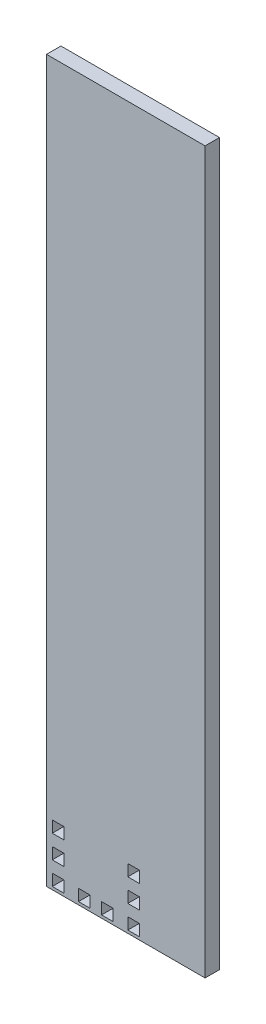
ISO-10303-21;
HEADER;
FILE_DESCRIPTION(('STEP AP214'),'2;1');
FILE_NAME('part.step','',(''),(''),'','','');
FILE_SCHEMA(('AUTOMOTIVE_DESIGN { 1 0 10303 214 1 1 1 1 }'));
ENDSEC;
DATA;
#1=APPLICATION_CONTEXT('core data for automotive mechanical design processes');
#2=APPLICATION_PROTOCOL_DEFINITION('international standard','automotive_design',2000,#1);
#3=PRODUCT_CONTEXT('',#1,'mechanical');
#4=PRODUCT('Part','Part','',(#3));
#5=PRODUCT_RELATED_PRODUCT_CATEGORY('part','',(#4));
#6=PRODUCT_DEFINITION_FORMATION('','',#4);
#7=PRODUCT_DEFINITION_CONTEXT('part definition',#1,'design');
#8=PRODUCT_DEFINITION('design','',#6,#7);
#9=PRODUCT_DEFINITION_SHAPE('','',#8);
#10=(LENGTH_UNIT() NAMED_UNIT(*) SI_UNIT(.MILLI.,.METRE.));
#11=(NAMED_UNIT(*) PLANE_ANGLE_UNIT() SI_UNIT($,.RADIAN.));
#12=(NAMED_UNIT(*) SI_UNIT($,.STERADIAN.) SOLID_ANGLE_UNIT());
#13=UNCERTAINTY_MEASURE_WITH_UNIT(LENGTH_MEASURE(1.E-05),#10,'distance_accuracy_value','');
#14=(GEOMETRIC_REPRESENTATION_CONTEXT(3) GLOBAL_UNCERTAINTY_ASSIGNED_CONTEXT((#13)) GLOBAL_UNIT_ASSIGNED_CONTEXT((#10,
#11,#12)) REPRESENTATION_CONTEXT('',''));
#15=CARTESIAN_POINT('',(0.,0.,0.));
#16=DIRECTION('',(0.,0.,1.));
#17=DIRECTION('',(1.,0.,0.));
#18=AXIS2_PLACEMENT_3D('',#15,#16,#17);
#19=CARTESIAN_POINT('',(0.,0.,5.));
#20=DIRECTION('',(0.,0.,-1.));
#21=DIRECTION('',(-1.,0.,0.));
#22=AXIS2_PLACEMENT_3D('',#19,#20,#21);
#23=PLANE('',#22);
#24=DIRECTION('',(0.,1.,0.));
#25=VECTOR('',#24,1.);
#26=CARTESIAN_POINT('',(15.1,1.,5.));
#27=LINE('',#26,#25);
#28=CARTESIAN_POINT('',(15.1,1.,5.));
#29=VERTEX_POINT('',#28);
#30=CARTESIAN_POINT('',(15.1,5.,5.));
#31=VERTEX_POINT('',#30);
#32=EDGE_CURVE('E302',#29,#31,#27,.T.);
#33=ORIENTED_EDGE('',*,*,#32,.F.);
#34=DIRECTION('',(1.,0.,0.));
#35=VECTOR('',#34,1.);
#36=CARTESIAN_POINT('',(15.1,1.,5.));
#37=LINE('',#36,#35);
#38=CARTESIAN_POINT('',(11.1,1.,5.));
#39=VERTEX_POINT('',#38);
#40=EDGE_CURVE('E310',#39,#29,#37,.T.);
#41=ORIENTED_EDGE('',*,*,#40,.F.);
#42=DIRECTION('',(0.,-1.,0.));
#43=VECTOR('',#42,1.);
#44=CARTESIAN_POINT('',(11.1,1.,5.));
#45=LINE('',#44,#43);
#46=CARTESIAN_POINT('',(11.1,5.,5.));
#47=VERTEX_POINT('',#46);
#48=EDGE_CURVE('E307',#47,#39,#45,.T.);
#49=ORIENTED_EDGE('',*,*,#48,.F.);
#50=DIRECTION('',(-1.,0.,0.));
#51=VECTOR('',#50,1.);
#52=CARTESIAN_POINT('',(15.1,5.,5.));
#53=LINE('',#52,#51);
#54=EDGE_CURVE('E304',#31,#47,#53,.T.);
#55=ORIENTED_EDGE('',*,*,#54,.F.);
#56=EDGE_LOOP('',(#33,#41,#49,#55));
#57=FACE_BOUND('',#56,.T.);
#58=DIRECTION('',(0.,1.,0.));
#59=VECTOR('',#58,1.);
#60=CARTESIAN_POINT('',(32.2,13.,5.));
#61=LINE('',#60,#59);
#62=CARTESIAN_POINT('',(32.2,9.00000000000001,5.));
#63=VERTEX_POINT('',#62);
#64=CARTESIAN_POINT('',(32.2,13.,5.));
#65=VERTEX_POINT('',#64);
#66=EDGE_CURVE('E364',#63,#65,#61,.T.);
#67=ORIENTED_EDGE('',*,*,#66,.F.);
#68=DIRECTION('',(1.,0.,0.));
#69=VECTOR('',#68,1.);
#70=CARTESIAN_POINT('',(32.2,9.00000000000001,5.));
#71=LINE('',#70,#69);
#72=CARTESIAN_POINT('',(28.2,9.00000000000001,5.));
#73=VERTEX_POINT('',#72);
#74=EDGE_CURVE('E372',#73,#63,#71,.T.);
#75=ORIENTED_EDGE('',*,*,#74,.F.);
#76=DIRECTION('',(0.,-1.,0.));
#77=VECTOR('',#76,1.);
#78=CARTESIAN_POINT('',(28.2,13.,5.));
#79=LINE('',#78,#77);
#80=CARTESIAN_POINT('',(28.2,13.,5.));
#81=VERTEX_POINT('',#80);
#82=EDGE_CURVE('E369',#81,#73,#79,.T.);
#83=ORIENTED_EDGE('',*,*,#82,.F.);
#84=DIRECTION('',(-1.,0.,0.));
#85=VECTOR('',#84,1.);
#86=CARTESIAN_POINT('',(32.2,13.,5.));
#87=LINE('',#86,#85);
#88=EDGE_CURVE('E366',#65,#81,#87,.T.);
#89=ORIENTED_EDGE('',*,*,#88,.F.);
#90=EDGE_LOOP('',(#67,#75,#83,#89));
#91=FACE_BOUND('',#90,.T.);
#92=DIRECTION('',(0.,-1.,0.));
#93=VECTOR('',#92,1.);
#94=CARTESIAN_POINT('',(28.2,21.,5.));
#95=LINE('',#94,#93);
#96=CARTESIAN_POINT('',(28.2,21.,5.));
#97=VERTEX_POINT('',#96);
#98=CARTESIAN_POINT('',(28.2,17.,5.));
#99=VERTEX_POINT('',#98);
#100=EDGE_CURVE('E426',#97,#99,#95,.T.);
#101=ORIENTED_EDGE('',*,*,#100,.F.);
#102=DIRECTION('',(-1.,0.,0.));
#103=VECTOR('',#102,1.);
#104=CARTESIAN_POINT('',(32.2,21.,5.));
#105=LINE('',#104,#103);
#106=CARTESIAN_POINT('',(32.2,21.,5.));
#107=VERTEX_POINT('',#106);
#108=EDGE_CURVE('E434',#107,#97,#105,.T.);
#109=ORIENTED_EDGE('',*,*,#108,.F.);
#110=DIRECTION('',(0.,1.,0.));
#111=VECTOR('',#110,1.);
#112=CARTESIAN_POINT('',(32.2,21.,5.));
#113=LINE('',#112,#111);
#114=CARTESIAN_POINT('',(32.2,17.,5.));
#115=VERTEX_POINT('',#114);
#116=EDGE_CURVE('E431',#115,#107,#113,.T.);
#117=ORIENTED_EDGE('',*,*,#116,.F.);
#118=DIRECTION('',(1.,0.,0.));
#119=VECTOR('',#118,1.);
#120=CARTESIAN_POINT('',(32.2,17.,5.));
#121=LINE('',#120,#119);
#122=EDGE_CURVE('E428',#99,#115,#121,.T.);
#123=ORIENTED_EDGE('',*,*,#122,.F.);
#124=EDGE_LOOP('',(#101,#109,#117,#123));
#125=FACE_BOUND('',#124,.T.);
#126=DIRECTION('',(0.,-1.,0.));
#127=VECTOR('',#126,1.);
#128=CARTESIAN_POINT('',(28.2,5.,5.));
#129=LINE('',#128,#127);
#130=CARTESIAN_POINT('',(28.2,5.,5.));
#131=VERTEX_POINT('',#130);
#132=CARTESIAN_POINT('',(28.2,1.,5.));
#133=VERTEX_POINT('',#132);
#134=EDGE_CURVE('E488',#131,#133,#129,.T.);
#135=ORIENTED_EDGE('',*,*,#134,.F.);
#136=DIRECTION('',(-1.,0.,0.));
#137=VECTOR('',#136,1.);
#138=CARTESIAN_POINT('',(32.2,5.,5.));
#139=LINE('',#138,#137);
#140=CARTESIAN_POINT('',(32.2,5.,5.));
#141=VERTEX_POINT('',#140);
#142=EDGE_CURVE('E496',#141,#131,#139,.T.);
#143=ORIENTED_EDGE('',*,*,#142,.F.);
#144=DIRECTION('',(0.,1.,0.));
#145=VECTOR('',#144,1.);
#146=CARTESIAN_POINT('',(32.2,5.,5.));
#147=LINE('',#146,#145);
#148=CARTESIAN_POINT('',(32.2,1.00000000000001,5.));
#149=VERTEX_POINT('',#148);
#150=EDGE_CURVE('E493',#149,#141,#147,.T.);
#151=ORIENTED_EDGE('',*,*,#150,.F.);
#152=DIRECTION('',(1.,0.,0.));
#153=VECTOR('',#152,1.);
#154=CARTESIAN_POINT('',(32.2,1.00000000000001,5.));
#155=LINE('',#154,#153);
#156=EDGE_CURVE('E490',#133,#149,#155,.T.);
#157=ORIENTED_EDGE('',*,*,#156,.F.);
#158=EDGE_LOOP('',(#135,#143,#151,#157));
#159=FACE_BOUND('',#158,.T.);
#160=DIRECTION('',(0.,-1.,0.));
#161=VECTOR('',#160,1.);
#162=CARTESIAN_POINT('',(0.,0.,5.));
#163=LINE('',#162,#161);
#164=CARTESIAN_POINT('',(0.,250.,5.));
#165=VERTEX_POINT('',#164);
#166=CARTESIAN_POINT('',(0.,0.,5.));
#167=VERTEX_POINT('',#166);
#168=EDGE_CURVE('E519',#165,#167,#163,.T.);
#169=ORIENTED_EDGE('',*,*,#168,.T.);
#170=DIRECTION('',(1.,0.,0.));
#171=VECTOR('',#170,1.);
#172=CARTESIAN_POINT('',(0.,0.,5.));
#173=LINE('',#172,#171);
#174=CARTESIAN_POINT('',(55.,0.,5.));
#175=VERTEX_POINT('',#174);
#176=EDGE_CURVE('E522',#167,#175,#173,.T.);
#177=ORIENTED_EDGE('',*,*,#176,.T.);
#178=DIRECTION('',(0.,1.,0.));
#179=VECTOR('',#178,1.);
#180=CARTESIAN_POINT('',(55.,0.,5.));
#181=LINE('',#180,#179);
#182=CARTESIAN_POINT('',(55.,250.,5.));
#183=VERTEX_POINT('',#182);
#184=EDGE_CURVE('E525',#175,#183,#181,.T.);
#185=ORIENTED_EDGE('',*,*,#184,.T.);
#186=DIRECTION('',(-1.,0.,0.));
#187=VECTOR('',#186,1.);
#188=CARTESIAN_POINT('',(0.,250.,5.));
#189=LINE('',#188,#187);
#190=EDGE_CURVE('E527',#183,#165,#189,.T.);
#191=ORIENTED_EDGE('',*,*,#190,.T.);
#192=EDGE_LOOP('',(#169,#177,#185,#191));
#193=FACE_BOUND('',#192,.T.);
#194=DIRECTION('',(-1.,0.,0.));
#195=VECTOR('',#194,1.);
#196=CARTESIAN_POINT('',(6.,5.,5.));
#197=LINE('',#196,#195);
#198=CARTESIAN_POINT('',(6.,5.,5.));
#199=VERTEX_POINT('',#198);
#200=CARTESIAN_POINT('',(2.,5.,5.));
#201=VERTEX_POINT('',#200);
#202=EDGE_CURVE('E457',#199,#201,#197,.T.);
#203=ORIENTED_EDGE('',*,*,#202,.F.);
#204=DIRECTION('',(0.,1.,0.));
#205=VECTOR('',#204,1.);
#206=CARTESIAN_POINT('',(6.,1.,5.));
#207=LINE('',#206,#205);
#208=CARTESIAN_POINT('',(6.,1.,5.));
#209=VERTEX_POINT('',#208);
#210=EDGE_CURVE('E465',#209,#199,#207,.T.);
#211=ORIENTED_EDGE('',*,*,#210,.F.);
#212=DIRECTION('',(1.,0.,0.));
#213=VECTOR('',#212,1.);
#214=CARTESIAN_POINT('',(6.,1.,5.));
#215=LINE('',#214,#213);
#216=CARTESIAN_POINT('',(2.,1.,5.));
#217=VERTEX_POINT('',#216);
#218=EDGE_CURVE('E462',#217,#209,#215,.T.);
#219=ORIENTED_EDGE('',*,*,#218,.F.);
#220=DIRECTION('',(0.,-1.,0.));
#221=VECTOR('',#220,1.);
#222=CARTESIAN_POINT('',(2.,1.,5.));
#223=LINE('',#222,#221);
#224=EDGE_CURVE('E459',#201,#217,#223,.T.);
#225=ORIENTED_EDGE('',*,*,#224,.F.);
#226=EDGE_LOOP('',(#203,#211,#219,#225));
#227=FACE_BOUND('',#226,.T.);
#228=DIRECTION('',(0.,1.,0.));
#229=VECTOR('',#228,1.);
#230=CARTESIAN_POINT('',(5.99999999999999,17.,5.));
#231=LINE('',#230,#229);
#232=CARTESIAN_POINT('',(5.99999999999999,17.,5.));
#233=VERTEX_POINT('',#232);
#234=CARTESIAN_POINT('',(5.99999999999999,21.,5.));
#235=VERTEX_POINT('',#234);
#236=EDGE_CURVE('E395',#233,#235,#231,.T.);
#237=ORIENTED_EDGE('',*,*,#236,.F.);
#238=DIRECTION('',(1.,0.,0.));
#239=VECTOR('',#238,1.);
#240=CARTESIAN_POINT('',(1.99999999999999,17.,5.));
#241=LINE('',#240,#239);
#242=CARTESIAN_POINT('',(1.99999999999999,17.,5.));
#243=VERTEX_POINT('',#242);
#244=EDGE_CURVE('E403',#243,#233,#241,.T.);
#245=ORIENTED_EDGE('',*,*,#244,.F.);
#246=DIRECTION('',(0.,-1.,0.));
#247=VECTOR('',#246,1.);
#248=CARTESIAN_POINT('',(1.99999999999999,17.,5.));
#249=LINE('',#248,#247);
#250=CARTESIAN_POINT('',(1.99999999999999,21.,5.));
#251=VERTEX_POINT('',#250);
#252=EDGE_CURVE('E400',#251,#243,#249,.T.);
#253=ORIENTED_EDGE('',*,*,#252,.F.);
#254=DIRECTION('',(-1.,0.,0.));
#255=VECTOR('',#254,1.);
#256=CARTESIAN_POINT('',(1.99999999999999,21.,5.));
#257=LINE('',#256,#255);
#258=EDGE_CURVE('E397',#235,#251,#257,.T.);
#259=ORIENTED_EDGE('',*,*,#258,.F.);
#260=EDGE_LOOP('',(#237,#245,#253,#259));
#261=FACE_BOUND('',#260,.T.);
#262=DIRECTION('',(0.,1.,0.));
#263=VECTOR('',#262,1.);
#264=CARTESIAN_POINT('',(23.1,1.,5.));
#265=LINE('',#264,#263);
#266=CARTESIAN_POINT('',(23.1,1.,5.));
#267=VERTEX_POINT('',#266);
#268=CARTESIAN_POINT('',(23.1,5.,5.));
#269=VERTEX_POINT('',#268);
#270=EDGE_CURVE('E333',#267,#269,#265,.T.);
#271=ORIENTED_EDGE('',*,*,#270,.F.);
#272=DIRECTION('',(1.,0.,0.));
#273=VECTOR('',#272,1.);
#274=CARTESIAN_POINT('',(23.1,1.,5.));
#275=LINE('',#274,#273);
#276=CARTESIAN_POINT('',(19.1,1.,5.));
#277=VERTEX_POINT('',#276);
#278=EDGE_CURVE('E341',#277,#267,#275,.T.);
#279=ORIENTED_EDGE('',*,*,#278,.F.);
#280=DIRECTION('',(0.,-1.,0.));
#281=VECTOR('',#280,1.);
#282=CARTESIAN_POINT('',(19.1,1.,5.));
#283=LINE('',#282,#281);
#284=CARTESIAN_POINT('',(19.1,5.,5.));
#285=VERTEX_POINT('',#284);
#286=EDGE_CURVE('E338',#285,#277,#283,.T.);
#287=ORIENTED_EDGE('',*,*,#286,.F.);
#288=DIRECTION('',(-1.,0.,0.));
#289=VECTOR('',#288,1.);
#290=CARTESIAN_POINT('',(23.1,5.,5.));
#291=LINE('',#290,#289);
#292=EDGE_CURVE('E335',#269,#285,#291,.T.);
#293=ORIENTED_EDGE('',*,*,#292,.F.);
#294=EDGE_LOOP('',(#271,#279,#287,#293));
#295=FACE_BOUND('',#294,.T.);
#296=DIRECTION('',(0.,-1.,0.));
#297=VECTOR('',#296,1.);
#298=CARTESIAN_POINT('',(2.,9.,5.));
#299=LINE('',#298,#297);
#300=CARTESIAN_POINT('',(2.,13.,5.));
#301=VERTEX_POINT('',#300);
#302=CARTESIAN_POINT('',(2.,9.,5.));
#303=VERTEX_POINT('',#302);
#304=EDGE_CURVE('E266',#301,#303,#299,.T.);
#305=ORIENTED_EDGE('',*,*,#304,.F.);
#306=DIRECTION('',(-1.,0.,0.));
#307=VECTOR('',#306,1.);
#308=CARTESIAN_POINT('',(2.,13.,5.));
#309=LINE('',#308,#307);
#310=CARTESIAN_POINT('',(6.,13.,5.));
#311=VERTEX_POINT('',#310);
#312=EDGE_CURVE('E288',#311,#301,#309,.T.);
#313=ORIENTED_EDGE('',*,*,#312,.F.);
#314=DIRECTION('',(0.,1.,0.));
#315=VECTOR('',#314,1.);
#316=CARTESIAN_POINT('',(6.,9.,5.));
#317=LINE('',#316,#315);
#318=CARTESIAN_POINT('',(6.,9.,5.));
#319=VERTEX_POINT('',#318);
#320=EDGE_CURVE('E286',#319,#311,#317,.T.);
#321=ORIENTED_EDGE('',*,*,#320,.F.);
#322=DIRECTION('',(1.,0.,0.));
#323=VECTOR('',#322,1.);
#324=CARTESIAN_POINT('',(2.,9.,5.));
#325=LINE('',#324,#323);
#326=EDGE_CURVE('E274',#303,#319,#325,.T.);
#327=ORIENTED_EDGE('',*,*,#326,.F.);
#328=EDGE_LOOP('',(#305,#313,#321,#327));
#329=FACE_BOUND('',#328,.T.);
#330=ADVANCED_FACE('F33',(#57,#91,#125,#159,#193,#227,#261,#295,#329),#23,.F.);
#331=CARTESIAN_POINT('',(0.,0.,0.));
#332=DIRECTION('',(0.,0.,-1.));
#333=DIRECTION('',(-1.,0.,0.));
#334=AXIS2_PLACEMENT_3D('',#331,#332,#333);
#335=PLANE('',#334);
#336=DIRECTION('',(1.,0.,0.));
#337=VECTOR('',#336,1.);
#338=CARTESIAN_POINT('',(15.1,1.,0.));
#339=LINE('',#338,#337);
#340=CARTESIAN_POINT('',(11.1,1.,0.));
#341=VERTEX_POINT('',#340);
#342=CARTESIAN_POINT('',(15.1,1.,0.));
#343=VERTEX_POINT('',#342);
#344=EDGE_CURVE('E305',#341,#343,#339,.T.);
#345=ORIENTED_EDGE('',*,*,#344,.T.);
#346=DIRECTION('',(0.,1.,0.));
#347=VECTOR('',#346,1.);
#348=CARTESIAN_POINT('',(15.1,1.,0.));
#349=LINE('',#348,#347);
#350=CARTESIAN_POINT('',(15.1,5.,0.));
#351=VERTEX_POINT('',#350);
#352=EDGE_CURVE('E282',#343,#351,#349,.T.);
#353=ORIENTED_EDGE('',*,*,#352,.T.);
#354=DIRECTION('',(-1.,0.,0.));
#355=VECTOR('',#354,1.);
#356=CARTESIAN_POINT('',(15.1,5.,0.));
#357=LINE('',#356,#355);
#358=CARTESIAN_POINT('',(11.1,5.,0.));
#359=VERTEX_POINT('',#358);
#360=EDGE_CURVE('E315',#351,#359,#357,.T.);
#361=ORIENTED_EDGE('',*,*,#360,.T.);
#362=DIRECTION('',(0.,-1.,0.));
#363=VECTOR('',#362,1.);
#364=CARTESIAN_POINT('',(11.1,1.,0.));
#365=LINE('',#364,#363);
#366=EDGE_CURVE('E318',#359,#341,#365,.T.);
#367=ORIENTED_EDGE('',*,*,#366,.T.);
#368=EDGE_LOOP('',(#345,#353,#361,#367));
#369=FACE_BOUND('',#368,.T.);
#370=DIRECTION('',(1.,0.,0.));
#371=VECTOR('',#370,1.);
#372=CARTESIAN_POINT('',(32.2,9.00000000000001,0.));
#373=LINE('',#372,#371);
#374=CARTESIAN_POINT('',(28.2,9.00000000000001,0.));
#375=VERTEX_POINT('',#374);
#376=CARTESIAN_POINT('',(32.2,9.00000000000001,0.));
#377=VERTEX_POINT('',#376);
#378=EDGE_CURVE('E367',#375,#377,#373,.T.);
#379=ORIENTED_EDGE('',*,*,#378,.T.);
#380=DIRECTION('',(0.,1.,0.));
#381=VECTOR('',#380,1.);
#382=CARTESIAN_POINT('',(32.2,13.,0.));
#383=LINE('',#382,#381);
#384=CARTESIAN_POINT('',(32.2,13.,0.));
#385=VERTEX_POINT('',#384);
#386=EDGE_CURVE('E363',#377,#385,#383,.T.);
#387=ORIENTED_EDGE('',*,*,#386,.T.);
#388=DIRECTION('',(-1.,0.,0.));
#389=VECTOR('',#388,1.);
#390=CARTESIAN_POINT('',(32.2,13.,0.));
#391=LINE('',#390,#389);
#392=CARTESIAN_POINT('',(28.2,13.,0.));
#393=VERTEX_POINT('',#392);
#394=EDGE_CURVE('E377',#385,#393,#391,.T.);
#395=ORIENTED_EDGE('',*,*,#394,.T.);
#396=DIRECTION('',(0.,-1.,0.));
#397=VECTOR('',#396,1.);
#398=CARTESIAN_POINT('',(28.2,13.,0.));
#399=LINE('',#398,#397);
#400=EDGE_CURVE('E380',#393,#375,#399,.T.);
#401=ORIENTED_EDGE('',*,*,#400,.T.);
#402=EDGE_LOOP('',(#379,#387,#395,#401));
#403=FACE_BOUND('',#402,.T.);
#404=DIRECTION('',(-1.,0.,0.));
#405=VECTOR('',#404,1.);
#406=CARTESIAN_POINT('',(32.2,21.,0.));
#407=LINE('',#406,#405);
#408=CARTESIAN_POINT('',(32.2,21.,0.));
#409=VERTEX_POINT('',#408);
#410=CARTESIAN_POINT('',(28.2,21.,0.));
#411=VERTEX_POINT('',#410);
#412=EDGE_CURVE('E429',#409,#411,#407,.T.);
#413=ORIENTED_EDGE('',*,*,#412,.T.);
#414=DIRECTION('',(0.,-1.,0.));
#415=VECTOR('',#414,1.);
#416=CARTESIAN_POINT('',(28.2,21.,0.));
#417=LINE('',#416,#415);
#418=CARTESIAN_POINT('',(28.2,17.,0.));
#419=VERTEX_POINT('',#418);
#420=EDGE_CURVE('E425',#411,#419,#417,.T.);
#421=ORIENTED_EDGE('',*,*,#420,.T.);
#422=DIRECTION('',(1.,0.,0.));
#423=VECTOR('',#422,1.);
#424=CARTESIAN_POINT('',(32.2,17.,0.));
#425=LINE('',#424,#423);
#426=CARTESIAN_POINT('',(32.2,17.,0.));
#427=VERTEX_POINT('',#426);
#428=EDGE_CURVE('E439',#419,#427,#425,.T.);
#429=ORIENTED_EDGE('',*,*,#428,.T.);
#430=DIRECTION('',(0.,1.,0.));
#431=VECTOR('',#430,1.);
#432=CARTESIAN_POINT('',(32.2,21.,0.));
#433=LINE('',#432,#431);
#434=EDGE_CURVE('E442',#427,#409,#433,.T.);
#435=ORIENTED_EDGE('',*,*,#434,.T.);
#436=EDGE_LOOP('',(#413,#421,#429,#435));
#437=FACE_BOUND('',#436,.T.);
#438=DIRECTION('',(-1.,0.,0.));
#439=VECTOR('',#438,1.);
#440=CARTESIAN_POINT('',(32.2,5.,0.));
#441=LINE('',#440,#439);
#442=CARTESIAN_POINT('',(32.2,5.,0.));
#443=VERTEX_POINT('',#442);
#444=CARTESIAN_POINT('',(28.2,5.,0.));
#445=VERTEX_POINT('',#444);
#446=EDGE_CURVE('E491',#443,#445,#441,.T.);
#447=ORIENTED_EDGE('',*,*,#446,.T.);
#448=DIRECTION('',(0.,-1.,0.));
#449=VECTOR('',#448,1.);
#450=CARTESIAN_POINT('',(28.2,5.,0.));
#451=LINE('',#450,#449);
#452=CARTESIAN_POINT('',(28.2,1.,0.));
#453=VERTEX_POINT('',#452);
#454=EDGE_CURVE('E487',#445,#453,#451,.T.);
#455=ORIENTED_EDGE('',*,*,#454,.T.);
#456=DIRECTION('',(1.,0.,0.));
#457=VECTOR('',#456,1.);
#458=CARTESIAN_POINT('',(32.2,1.00000000000001,0.));
#459=LINE('',#458,#457);
#460=CARTESIAN_POINT('',(32.2,1.00000000000001,0.));
#461=VERTEX_POINT('',#460);
#462=EDGE_CURVE('E501',#453,#461,#459,.T.);
#463=ORIENTED_EDGE('',*,*,#462,.T.);
#464=DIRECTION('',(0.,1.,0.));
#465=VECTOR('',#464,1.);
#466=CARTESIAN_POINT('',(32.2,5.,0.));
#467=LINE('',#466,#465);
#468=EDGE_CURVE('E504',#461,#443,#467,.T.);
#469=ORIENTED_EDGE('',*,*,#468,.T.);
#470=EDGE_LOOP('',(#447,#455,#463,#469));
#471=FACE_BOUND('',#470,.T.);
#472=DIRECTION('',(0.,-1.,0.));
#473=VECTOR('',#472,1.);
#474=CARTESIAN_POINT('',(0.,0.,0.));
#475=LINE('',#474,#473);
#476=CARTESIAN_POINT('',(0.,250.,0.));
#477=VERTEX_POINT('',#476);
#478=CARTESIAN_POINT('',(0.,0.,0.));
#479=VERTEX_POINT('',#478);
#480=EDGE_CURVE('E518',#477,#479,#475,.T.);
#481=ORIENTED_EDGE('',*,*,#480,.F.);
#482=DIRECTION('',(-1.,0.,0.));
#483=VECTOR('',#482,1.);
#484=CARTESIAN_POINT('',(0.,250.,0.));
#485=LINE('',#484,#483);
#486=CARTESIAN_POINT('',(55.,250.,0.));
#487=VERTEX_POINT('',#486);
#488=EDGE_CURVE('E523',#487,#477,#485,.T.);
#489=ORIENTED_EDGE('',*,*,#488,.F.);
#490=DIRECTION('',(0.,1.,0.));
#491=VECTOR('',#490,1.);
#492=CARTESIAN_POINT('',(55.,0.,0.));
#493=LINE('',#492,#491);
#494=CARTESIAN_POINT('',(55.,0.,0.));
#495=VERTEX_POINT('',#494);
#496=EDGE_CURVE('E534',#495,#487,#493,.T.);
#497=ORIENTED_EDGE('',*,*,#496,.F.);
#498=DIRECTION('',(1.,0.,0.));
#499=VECTOR('',#498,1.);
#500=CARTESIAN_POINT('',(0.,0.,0.));
#501=LINE('',#500,#499);
#502=EDGE_CURVE('E532',#479,#495,#501,.T.);
#503=ORIENTED_EDGE('',*,*,#502,.F.);
#504=EDGE_LOOP('',(#481,#489,#497,#503));
#505=FACE_BOUND('',#504,.T.);
#506=DIRECTION('',(0.,1.,0.));
#507=VECTOR('',#506,1.);
#508=CARTESIAN_POINT('',(6.,1.,0.));
#509=LINE('',#508,#507);
#510=CARTESIAN_POINT('',(6.,1.,0.));
#511=VERTEX_POINT('',#510);
#512=CARTESIAN_POINT('',(6.,5.,0.));
#513=VERTEX_POINT('',#512);
#514=EDGE_CURVE('E460',#511,#513,#509,.T.);
#515=ORIENTED_EDGE('',*,*,#514,.T.);
#516=DIRECTION('',(-1.,0.,0.));
#517=VECTOR('',#516,1.);
#518=CARTESIAN_POINT('',(6.,5.,0.));
#519=LINE('',#518,#517);
#520=CARTESIAN_POINT('',(2.,5.,0.));
#521=VERTEX_POINT('',#520);
#522=EDGE_CURVE('E456',#513,#521,#519,.T.);
#523=ORIENTED_EDGE('',*,*,#522,.T.);
#524=DIRECTION('',(0.,-1.,0.));
#525=VECTOR('',#524,1.);
#526=CARTESIAN_POINT('',(2.,1.,0.));
#527=LINE('',#526,#525);
#528=CARTESIAN_POINT('',(2.,1.,0.));
#529=VERTEX_POINT('',#528);
#530=EDGE_CURVE('E470',#521,#529,#527,.T.);
#531=ORIENTED_EDGE('',*,*,#530,.T.);
#532=DIRECTION('',(1.,0.,0.));
#533=VECTOR('',#532,1.);
#534=CARTESIAN_POINT('',(6.,1.,0.));
#535=LINE('',#534,#533);
#536=EDGE_CURVE('E473',#529,#511,#535,.T.);
#537=ORIENTED_EDGE('',*,*,#536,.T.);
#538=EDGE_LOOP('',(#515,#523,#531,#537));
#539=FACE_BOUND('',#538,.T.);
#540=DIRECTION('',(1.,0.,0.));
#541=VECTOR('',#540,1.);
#542=CARTESIAN_POINT('',(1.99999999999999,17.,0.));
#543=LINE('',#542,#541);
#544=CARTESIAN_POINT('',(1.99999999999999,17.,0.));
#545=VERTEX_POINT('',#544);
#546=CARTESIAN_POINT('',(5.99999999999999,17.,0.));
#547=VERTEX_POINT('',#546);
#548=EDGE_CURVE('E398',#545,#547,#543,.T.);
#549=ORIENTED_EDGE('',*,*,#548,.T.);
#550=DIRECTION('',(0.,1.,0.));
#551=VECTOR('',#550,1.);
#552=CARTESIAN_POINT('',(5.99999999999999,17.,0.));
#553=LINE('',#552,#551);
#554=CARTESIAN_POINT('',(5.99999999999999,21.,0.));
#555=VERTEX_POINT('',#554);
#556=EDGE_CURVE('E394',#547,#555,#553,.T.);
#557=ORIENTED_EDGE('',*,*,#556,.T.);
#558=DIRECTION('',(-1.,0.,0.));
#559=VECTOR('',#558,1.);
#560=CARTESIAN_POINT('',(1.99999999999999,21.,0.));
#561=LINE('',#560,#559);
#562=CARTESIAN_POINT('',(1.99999999999999,21.,0.));
#563=VERTEX_POINT('',#562);
#564=EDGE_CURVE('E408',#555,#563,#561,.T.);
#565=ORIENTED_EDGE('',*,*,#564,.T.);
#566=DIRECTION('',(0.,-1.,0.));
#567=VECTOR('',#566,1.);
#568=CARTESIAN_POINT('',(1.99999999999999,17.,0.));
#569=LINE('',#568,#567);
#570=EDGE_CURVE('E411',#563,#545,#569,.T.);
#571=ORIENTED_EDGE('',*,*,#570,.T.);
#572=EDGE_LOOP('',(#549,#557,#565,#571));
#573=FACE_BOUND('',#572,.T.);
#574=DIRECTION('',(1.,0.,0.));
#575=VECTOR('',#574,1.);
#576=CARTESIAN_POINT('',(23.1,1.,0.));
#577=LINE('',#576,#575);
#578=CARTESIAN_POINT('',(19.1,1.,0.));
#579=VERTEX_POINT('',#578);
#580=CARTESIAN_POINT('',(23.1,1.,0.));
#581=VERTEX_POINT('',#580);
#582=EDGE_CURVE('E336',#579,#581,#577,.T.);
#583=ORIENTED_EDGE('',*,*,#582,.T.);
#584=DIRECTION('',(0.,1.,0.));
#585=VECTOR('',#584,1.);
#586=CARTESIAN_POINT('',(23.1,1.,0.));
#587=LINE('',#586,#585);
#588=CARTESIAN_POINT('',(23.1,5.,0.));
#589=VERTEX_POINT('',#588);
#590=EDGE_CURVE('E332',#581,#589,#587,.T.);
#591=ORIENTED_EDGE('',*,*,#590,.T.);
#592=DIRECTION('',(-1.,0.,0.));
#593=VECTOR('',#592,1.);
#594=CARTESIAN_POINT('',(23.1,5.,0.));
#595=LINE('',#594,#593);
#596=CARTESIAN_POINT('',(19.1,5.,0.));
#597=VERTEX_POINT('',#596);
#598=EDGE_CURVE('E346',#589,#597,#595,.T.);
#599=ORIENTED_EDGE('',*,*,#598,.T.);
#600=DIRECTION('',(0.,-1.,0.));
#601=VECTOR('',#600,1.);
#602=CARTESIAN_POINT('',(19.1,1.,0.));
#603=LINE('',#602,#601);
#604=EDGE_CURVE('E349',#597,#579,#603,.T.);
#605=ORIENTED_EDGE('',*,*,#604,.T.);
#606=EDGE_LOOP('',(#583,#591,#599,#605));
#607=FACE_BOUND('',#606,.T.);
#608=DIRECTION('',(-1.,0.,0.));
#609=VECTOR('',#608,1.);
#610=CARTESIAN_POINT('',(2.,13.,0.));
#611=LINE('',#610,#609);
#612=CARTESIAN_POINT('',(6.,13.,0.));
#613=VERTEX_POINT('',#612);
#614=CARTESIAN_POINT('',(2.,13.,0.));
#615=VERTEX_POINT('',#614);
#616=EDGE_CURVE('E275',#613,#615,#611,.T.);
#617=ORIENTED_EDGE('',*,*,#616,.T.);
#618=DIRECTION('',(0.,-1.,0.));
#619=VECTOR('',#618,1.);
#620=CARTESIAN_POINT('',(2.,9.,0.));
#621=LINE('',#620,#619);
#622=CARTESIAN_POINT('',(2.,9.,0.));
#623=VERTEX_POINT('',#622);
#624=EDGE_CURVE('E56',#615,#623,#621,.T.);
#625=ORIENTED_EDGE('',*,*,#624,.T.);
#626=DIRECTION('',(1.,0.,0.));
#627=VECTOR('',#626,1.);
#628=CARTESIAN_POINT('',(2.,9.,0.));
#629=LINE('',#628,#627);
#630=CARTESIAN_POINT('',(6.,9.,0.));
#631=VERTEX_POINT('',#630);
#632=EDGE_CURVE('E281',#623,#631,#629,.T.);
#633=ORIENTED_EDGE('',*,*,#632,.T.);
#634=DIRECTION('',(0.,1.,0.));
#635=VECTOR('',#634,1.);
#636=CARTESIAN_POINT('',(6.,9.,0.));
#637=LINE('',#636,#635);
#638=EDGE_CURVE('E294',#631,#613,#637,.T.);
#639=ORIENTED_EDGE('',*,*,#638,.T.);
#640=EDGE_LOOP('',(#617,#625,#633,#639));
#641=FACE_BOUND('',#640,.T.);
#642=ADVANCED_FACE('F552',(#369,#403,#437,#471,#505,#539,#573,#607,#641),#335,.T.);
#643=CARTESIAN_POINT('',(0.,0.,5.));
#644=DIRECTION('',(1.,0.,0.));
#645=DIRECTION('',(0.,0.,-1.));
#646=AXIS2_PLACEMENT_3D('',#643,#644,#645);
#647=PLANE('',#646);
#648=ORIENTED_EDGE('',*,*,#480,.T.);
#649=DIRECTION('',(0.,0.,-1.));
#650=VECTOR('',#649,1.);
#651=CARTESIAN_POINT('',(0.,0.,5.));
#652=LINE('',#651,#650);
#653=EDGE_CURVE('E11',#167,#479,#652,.T.);
#654=ORIENTED_EDGE('',*,*,#653,.F.);
#655=ORIENTED_EDGE('',*,*,#168,.F.);
#656=DIRECTION('',(0.,0.,-1.));
#657=VECTOR('',#656,1.);
#658=CARTESIAN_POINT('',(0.,250.,5.));
#659=LINE('',#658,#657);
#660=EDGE_CURVE('E529',#165,#477,#659,.T.);
#661=ORIENTED_EDGE('',*,*,#660,.T.);
#662=EDGE_LOOP('',(#648,#654,#655,#661));
#663=FACE_BOUND('',#662,.T.);
#664=ADVANCED_FACE('F35',(#663),#647,.F.);
#665=CARTESIAN_POINT('',(0.,0.,5.));
#666=DIRECTION('',(0.,1.,0.));
#667=DIRECTION('',(0.,0.,1.));
#668=AXIS2_PLACEMENT_3D('',#665,#666,#667);
#669=PLANE('',#668);
#670=ORIENTED_EDGE('',*,*,#502,.T.);
#671=DIRECTION('',(0.,0.,-1.));
#672=VECTOR('',#671,1.);
#673=CARTESIAN_POINT('',(55.,0.,5.));
#674=LINE('',#673,#672);
#675=EDGE_CURVE('E41',#175,#495,#674,.T.);
#676=ORIENTED_EDGE('',*,*,#675,.F.);
#677=ORIENTED_EDGE('',*,*,#176,.F.);
#678=ORIENTED_EDGE('',*,*,#653,.T.);
#679=EDGE_LOOP('',(#670,#676,#677,#678));
#680=FACE_BOUND('',#679,.T.);
#681=ADVANCED_FACE('F563',(#680),#669,.F.);
#682=CARTESIAN_POINT('',(55.,0.,5.));
#683=DIRECTION('',(-1.,0.,0.));
#684=DIRECTION('',(0.,0.,1.));
#685=AXIS2_PLACEMENT_3D('',#682,#683,#684);
#686=PLANE('',#685);
#687=ORIENTED_EDGE('',*,*,#496,.T.);
#688=DIRECTION('',(0.,0.,-1.));
#689=VECTOR('',#688,1.);
#690=CARTESIAN_POINT('',(55.,250.,5.));
#691=LINE('',#690,#689);
#692=EDGE_CURVE('E539',#183,#487,#691,.T.);
#693=ORIENTED_EDGE('',*,*,#692,.F.);
#694=ORIENTED_EDGE('',*,*,#184,.F.);
#695=ORIENTED_EDGE('',*,*,#675,.T.);
#696=EDGE_LOOP('',(#687,#693,#694,#695));
#697=FACE_BOUND('',#696,.T.);
#698=ADVANCED_FACE('F546',(#697),#686,.F.);
#699=CARTESIAN_POINT('',(0.,250.,5.));
#700=DIRECTION('',(0.,-1.,0.));
#701=DIRECTION('',(0.,0.,-1.));
#702=AXIS2_PLACEMENT_3D('',#699,#700,#701);
#703=PLANE('',#702);
#704=ORIENTED_EDGE('',*,*,#488,.T.);
#705=ORIENTED_EDGE('',*,*,#660,.F.);
#706=ORIENTED_EDGE('',*,*,#190,.F.);
#707=ORIENTED_EDGE('',*,*,#692,.T.);
#708=EDGE_LOOP('',(#704,#705,#706,#707));
#709=FACE_BOUND('',#708,.T.);
#710=ADVANCED_FACE('F556',(#709),#703,.F.);
#711=CARTESIAN_POINT('',(28.2,5.,5.));
#712=DIRECTION('',(1.,0.,0.));
#713=DIRECTION('',(0.,0.,-1.));
#714=AXIS2_PLACEMENT_3D('',#711,#712,#713);
#715=PLANE('',#714);
#716=ORIENTED_EDGE('',*,*,#454,.F.);
#717=DIRECTION('',(0.,0.,-1.));
#718=VECTOR('',#717,1.);
#719=CARTESIAN_POINT('',(28.2,5.,5.));
#720=LINE('',#719,#718);
#721=EDGE_CURVE('E498',#131,#445,#720,.T.);
#722=ORIENTED_EDGE('',*,*,#721,.F.);
#723=ORIENTED_EDGE('',*,*,#134,.T.);
#724=DIRECTION('',(0.,0.,-1.));
#725=VECTOR('',#724,1.);
#726=CARTESIAN_POINT('',(28.2,1.,5.));
#727=LINE('',#726,#725);
#728=EDGE_CURVE('E515',#133,#453,#727,.T.);
#729=ORIENTED_EDGE('',*,*,#728,.T.);
#730=EDGE_LOOP('',(#716,#722,#723,#729));
#731=FACE_BOUND('',#730,.T.);
#732=ADVANCED_FACE('F581',(#731),#715,.T.);
#733=CARTESIAN_POINT('',(32.2,1.00000000000001,5.));
#734=DIRECTION('',(0.,1.,0.));
#735=DIRECTION('',(-1.,0.,0.));
#736=AXIS2_PLACEMENT_3D('',#733,#734,#735);
#737=PLANE('',#736);
#738=ORIENTED_EDGE('',*,*,#462,.F.);
#739=ORIENTED_EDGE('',*,*,#728,.F.);
#740=ORIENTED_EDGE('',*,*,#156,.T.);
#741=DIRECTION('',(0.,0.,-1.));
#742=VECTOR('',#741,1.);
#743=CARTESIAN_POINT('',(32.2,1.00000000000001,5.));
#744=LINE('',#743,#742);
#745=EDGE_CURVE('E513',#149,#461,#744,.T.);
#746=ORIENTED_EDGE('',*,*,#745,.T.);
#747=EDGE_LOOP('',(#738,#739,#740,#746));
#748=FACE_BOUND('',#747,.T.);
#749=ADVANCED_FACE('F588',(#748),#737,.T.);
#750=CARTESIAN_POINT('',(32.2,5.,5.));
#751=DIRECTION('',(-1.,0.,0.));
#752=DIRECTION('',(0.,0.,1.));
#753=AXIS2_PLACEMENT_3D('',#750,#751,#752);
#754=PLANE('',#753);
#755=ORIENTED_EDGE('',*,*,#468,.F.);
#756=ORIENTED_EDGE('',*,*,#745,.F.);
#757=ORIENTED_EDGE('',*,*,#150,.T.);
#758=DIRECTION('',(0.,0.,-1.));
#759=VECTOR('',#758,1.);
#760=CARTESIAN_POINT('',(32.2,5.,5.));
#761=LINE('',#760,#759);
#762=EDGE_CURVE('E511',#141,#443,#761,.T.);
#763=ORIENTED_EDGE('',*,*,#762,.T.);
#764=EDGE_LOOP('',(#755,#756,#757,#763));
#765=FACE_BOUND('',#764,.T.);
#766=ADVANCED_FACE('F593',(#765),#754,.T.);
#767=CARTESIAN_POINT('',(32.2,5.,5.));
#768=DIRECTION('',(0.,-1.,0.));
#769=DIRECTION('',(0.,0.,-1.));
#770=AXIS2_PLACEMENT_3D('',#767,#768,#769);
#771=PLANE('',#770);
#772=ORIENTED_EDGE('',*,*,#446,.F.);
#773=ORIENTED_EDGE('',*,*,#762,.F.);
#774=ORIENTED_EDGE('',*,*,#142,.T.);
#775=ORIENTED_EDGE('',*,*,#721,.T.);
#776=EDGE_LOOP('',(#772,#773,#774,#775));
#777=FACE_BOUND('',#776,.T.);
#778=ADVANCED_FACE('F601',(#777),#771,.T.);
#779=CARTESIAN_POINT('',(6.,5.,5.));
#780=DIRECTION('',(0.,-1.,0.));
#781=DIRECTION('',(1.,0.,0.));
#782=AXIS2_PLACEMENT_3D('',#779,#780,#781);
#783=PLANE('',#782);
#784=ORIENTED_EDGE('',*,*,#522,.F.);
#785=DIRECTION('',(0.,0.,-1.));
#786=VECTOR('',#785,1.);
#787=CARTESIAN_POINT('',(6.,5.,5.));
#788=LINE('',#787,#786);
#789=EDGE_CURVE('E467',#199,#513,#788,.T.);
#790=ORIENTED_EDGE('',*,*,#789,.F.);
#791=ORIENTED_EDGE('',*,*,#202,.T.);
#792=DIRECTION('',(0.,0.,-1.));
#793=VECTOR('',#792,1.);
#794=CARTESIAN_POINT('',(2.,5.,5.));
#795=LINE('',#794,#793);
#796=EDGE_CURVE('E484',#201,#521,#795,.T.);
#797=ORIENTED_EDGE('',*,*,#796,.T.);
#798=EDGE_LOOP('',(#784,#790,#791,#797));
#799=FACE_BOUND('',#798,.T.);
#800=ADVANCED_FACE('F614',(#799),#783,.T.);
#801=CARTESIAN_POINT('',(2.,1.,5.));
#802=DIRECTION('',(1.,0.,0.));
#803=DIRECTION('',(0.,0.,-1.));
#804=AXIS2_PLACEMENT_3D('',#801,#802,#803);
#805=PLANE('',#804);
#806=ORIENTED_EDGE('',*,*,#530,.F.);
#807=ORIENTED_EDGE('',*,*,#796,.F.);
#808=ORIENTED_EDGE('',*,*,#224,.T.);
#809=DIRECTION('',(0.,0.,-1.));
#810=VECTOR('',#809,1.);
#811=CARTESIAN_POINT('',(2.,1.,5.));
#812=LINE('',#811,#810);
#813=EDGE_CURVE('E482',#217,#529,#812,.T.);
#814=ORIENTED_EDGE('',*,*,#813,.T.);
#815=EDGE_LOOP('',(#806,#807,#808,#814));
#816=FACE_BOUND('',#815,.T.);
#817=ADVANCED_FACE('F619',(#816),#805,.T.);
#818=CARTESIAN_POINT('',(6.,1.,5.));
#819=DIRECTION('',(0.,1.,0.));
#820=DIRECTION('',(-1.,0.,0.));
#821=AXIS2_PLACEMENT_3D('',#818,#819,#820);
#822=PLANE('',#821);
#823=ORIENTED_EDGE('',*,*,#536,.F.);
#824=ORIENTED_EDGE('',*,*,#813,.F.);
#825=ORIENTED_EDGE('',*,*,#218,.T.);
#826=DIRECTION('',(0.,0.,-1.));
#827=VECTOR('',#826,1.);
#828=CARTESIAN_POINT('',(6.,1.,5.));
#829=LINE('',#828,#827);
#830=EDGE_CURVE('E480',#209,#511,#829,.T.);
#831=ORIENTED_EDGE('',*,*,#830,.T.);
#832=EDGE_LOOP('',(#823,#824,#825,#831));
#833=FACE_BOUND('',#832,.T.);
#834=ADVANCED_FACE('F623',(#833),#822,.T.);
#835=CARTESIAN_POINT('',(6.,1.,5.));
#836=DIRECTION('',(-1.,0.,0.));
#837=DIRECTION('',(0.,-1.,0.));
#838=AXIS2_PLACEMENT_3D('',#835,#836,#837);
#839=PLANE('',#838);
#840=ORIENTED_EDGE('',*,*,#514,.F.);
#841=ORIENTED_EDGE('',*,*,#830,.F.);
#842=ORIENTED_EDGE('',*,*,#210,.T.);
#843=ORIENTED_EDGE('',*,*,#789,.T.);
#844=EDGE_LOOP('',(#840,#841,#842,#843));
#845=FACE_BOUND('',#844,.T.);
#846=ADVANCED_FACE('F627',(#845),#839,.T.);
#847=CARTESIAN_POINT('',(28.2,21.,5.));
#848=DIRECTION('',(1.,0.,0.));
#849=DIRECTION('',(0.,0.,-1.));
#850=AXIS2_PLACEMENT_3D('',#847,#848,#849);
#851=PLANE('',#850);
#852=ORIENTED_EDGE('',*,*,#420,.F.);
#853=DIRECTION('',(0.,0.,-1.));
#854=VECTOR('',#853,1.);
#855=CARTESIAN_POINT('',(28.2,21.,5.));
#856=LINE('',#855,#854);
#857=EDGE_CURVE('E436',#97,#411,#856,.T.);
#858=ORIENTED_EDGE('',*,*,#857,.F.);
#859=ORIENTED_EDGE('',*,*,#100,.T.);
#860=DIRECTION('',(0.,0.,-1.));
#861=VECTOR('',#860,1.);
#862=CARTESIAN_POINT('',(28.2,17.,5.));
#863=LINE('',#862,#861);
#864=EDGE_CURVE('E453',#99,#419,#863,.T.);
#865=ORIENTED_EDGE('',*,*,#864,.T.);
#866=EDGE_LOOP('',(#852,#858,#859,#865));
#867=FACE_BOUND('',#866,.T.);
#868=ADVANCED_FACE('F631',(#867),#851,.T.);
#869=CARTESIAN_POINT('',(32.2,17.,5.));
#870=DIRECTION('',(0.,1.,0.));
#871=DIRECTION('',(0.,0.,1.));
#872=AXIS2_PLACEMENT_3D('',#869,#870,#871);
#873=PLANE('',#872);
#874=ORIENTED_EDGE('',*,*,#428,.F.);
#875=ORIENTED_EDGE('',*,*,#864,.F.);
#876=ORIENTED_EDGE('',*,*,#122,.T.);
#877=DIRECTION('',(0.,0.,-1.));
#878=VECTOR('',#877,1.);
#879=CARTESIAN_POINT('',(32.2,17.,5.));
#880=LINE('',#879,#878);
#881=EDGE_CURVE('E451',#115,#427,#880,.T.);
#882=ORIENTED_EDGE('',*,*,#881,.T.);
#883=EDGE_LOOP('',(#874,#875,#876,#882));
#884=FACE_BOUND('',#883,.T.);
#885=ADVANCED_FACE('F635',(#884),#873,.T.);
#886=CARTESIAN_POINT('',(32.2,21.,5.));
#887=DIRECTION('',(-1.,0.,0.));
#888=DIRECTION('',(0.,-1.,0.));
#889=AXIS2_PLACEMENT_3D('',#886,#887,#888);
#890=PLANE('',#889);
#891=ORIENTED_EDGE('',*,*,#434,.F.);
#892=ORIENTED_EDGE('',*,*,#881,.F.);
#893=ORIENTED_EDGE('',*,*,#116,.T.);
#894=DIRECTION('',(0.,0.,-1.));
#895=VECTOR('',#894,1.);
#896=CARTESIAN_POINT('',(32.2,21.,5.));
#897=LINE('',#896,#895);
#898=EDGE_CURVE('E449',#107,#409,#897,.T.);
#899=ORIENTED_EDGE('',*,*,#898,.T.);
#900=EDGE_LOOP('',(#891,#892,#893,#899));
#901=FACE_BOUND('',#900,.T.);
#902=ADVANCED_FACE('F639',(#901),#890,.T.);
#903=CARTESIAN_POINT('',(32.2,21.,5.));
#904=DIRECTION('',(0.,-1.,0.));
#905=DIRECTION('',(0.,0.,-1.));
#906=AXIS2_PLACEMENT_3D('',#903,#904,#905);
#907=PLANE('',#906);
#908=ORIENTED_EDGE('',*,*,#412,.F.);
#909=ORIENTED_EDGE('',*,*,#898,.F.);
#910=ORIENTED_EDGE('',*,*,#108,.T.);
#911=ORIENTED_EDGE('',*,*,#857,.T.);
#912=EDGE_LOOP('',(#908,#909,#910,#911));
#913=FACE_BOUND('',#912,.T.);
#914=ADVANCED_FACE('F643',(#913),#907,.T.);
#915=CARTESIAN_POINT('',(5.99999999999999,17.,5.));
#916=DIRECTION('',(-1.,0.,0.));
#917=DIRECTION('',(0.,-1.,0.));
#918=AXIS2_PLACEMENT_3D('',#915,#916,#917);
#919=PLANE('',#918);
#920=ORIENTED_EDGE('',*,*,#556,.F.);
#921=DIRECTION('',(0.,0.,-1.));
#922=VECTOR('',#921,1.);
#923=CARTESIAN_POINT('',(5.99999999999999,17.,5.));
#924=LINE('',#923,#922);
#925=EDGE_CURVE('E405',#233,#547,#924,.T.);
#926=ORIENTED_EDGE('',*,*,#925,.F.);
#927=ORIENTED_EDGE('',*,*,#236,.T.);
#928=DIRECTION('',(0.,0.,-1.));
#929=VECTOR('',#928,1.);
#930=CARTESIAN_POINT('',(5.99999999999999,21.,5.));
#931=LINE('',#930,#929);
#932=EDGE_CURVE('E422',#235,#555,#931,.T.);
#933=ORIENTED_EDGE('',*,*,#932,.T.);
#934=EDGE_LOOP('',(#920,#926,#927,#933));
#935=FACE_BOUND('',#934,.T.);
#936=ADVANCED_FACE('F647',(#935),#919,.T.);
#937=CARTESIAN_POINT('',(1.99999999999999,21.,5.));
#938=DIRECTION('',(0.,-1.,0.));
#939=DIRECTION('',(1.,0.,0.));
#940=AXIS2_PLACEMENT_3D('',#937,#938,#939);
#941=PLANE('',#940);
#942=ORIENTED_EDGE('',*,*,#564,.F.);
#943=ORIENTED_EDGE('',*,*,#932,.F.);
#944=ORIENTED_EDGE('',*,*,#258,.T.);
#945=DIRECTION('',(0.,0.,-1.));
#946=VECTOR('',#945,1.);
#947=CARTESIAN_POINT('',(1.99999999999999,21.,5.));
#948=LINE('',#947,#946);
#949=EDGE_CURVE('E420',#251,#563,#948,.T.);
#950=ORIENTED_EDGE('',*,*,#949,.T.);
#951=EDGE_LOOP('',(#942,#943,#944,#950));
#952=FACE_BOUND('',#951,.T.);
#953=ADVANCED_FACE('F651',(#952),#941,.T.);
#954=CARTESIAN_POINT('',(1.99999999999999,17.,5.));
#955=DIRECTION('',(1.,0.,0.));
#956=DIRECTION('',(0.,1.,0.));
#957=AXIS2_PLACEMENT_3D('',#954,#955,#956);
#958=PLANE('',#957);
#959=ORIENTED_EDGE('',*,*,#570,.F.);
#960=ORIENTED_EDGE('',*,*,#949,.F.);
#961=ORIENTED_EDGE('',*,*,#252,.T.);
#962=DIRECTION('',(0.,0.,-1.));
#963=VECTOR('',#962,1.);
#964=CARTESIAN_POINT('',(1.99999999999999,17.,5.));
#965=LINE('',#964,#963);
#966=EDGE_CURVE('E418',#243,#545,#965,.T.);
#967=ORIENTED_EDGE('',*,*,#966,.T.);
#968=EDGE_LOOP('',(#959,#960,#961,#967));
#969=FACE_BOUND('',#968,.T.);
#970=ADVANCED_FACE('F655',(#969),#958,.T.);
#971=CARTESIAN_POINT('',(1.99999999999999,17.,5.));
#972=DIRECTION('',(0.,1.,0.));
#973=DIRECTION('',(0.,0.,1.));
#974=AXIS2_PLACEMENT_3D('',#971,#972,#973);
#975=PLANE('',#974);
#976=ORIENTED_EDGE('',*,*,#548,.F.);
#977=ORIENTED_EDGE('',*,*,#966,.F.);
#978=ORIENTED_EDGE('',*,*,#244,.T.);
#979=ORIENTED_EDGE('',*,*,#925,.T.);
#980=EDGE_LOOP('',(#976,#977,#978,#979));
#981=FACE_BOUND('',#980,.T.);
#982=ADVANCED_FACE('F659',(#981),#975,.T.);
#983=CARTESIAN_POINT('',(32.2,13.,5.));
#984=DIRECTION('',(-1.,0.,0.));
#985=DIRECTION('',(0.,0.,1.));
#986=AXIS2_PLACEMENT_3D('',#983,#984,#985);
#987=PLANE('',#986);
#988=ORIENTED_EDGE('',*,*,#386,.F.);
#989=DIRECTION('',(0.,0.,-1.));
#990=VECTOR('',#989,1.);
#991=CARTESIAN_POINT('',(32.2,9.00000000000001,5.));
#992=LINE('',#991,#990);
#993=EDGE_CURVE('E374',#63,#377,#992,.T.);
#994=ORIENTED_EDGE('',*,*,#993,.F.);
#995=ORIENTED_EDGE('',*,*,#66,.T.);
#996=DIRECTION('',(0.,0.,-1.));
#997=VECTOR('',#996,1.);
#998=CARTESIAN_POINT('',(32.2,13.,5.));
#999=LINE('',#998,#997);
#1000=EDGE_CURVE('E391',#65,#385,#999,.T.);
#1001=ORIENTED_EDGE('',*,*,#1000,.T.);
#1002=EDGE_LOOP('',(#988,#994,#995,#1001));
#1003=FACE_BOUND('',#1002,.T.);
#1004=ADVANCED_FACE('F663',(#1003),#987,.T.);
#1005=CARTESIAN_POINT('',(32.2,13.,5.));
#1006=DIRECTION('',(0.,-1.,0.));
#1007=DIRECTION('',(0.,0.,-1.));
#1008=AXIS2_PLACEMENT_3D('',#1005,#1006,#1007);
#1009=PLANE('',#1008);
#1010=ORIENTED_EDGE('',*,*,#394,.F.);
#1011=ORIENTED_EDGE('',*,*,#1000,.F.);
#1012=ORIENTED_EDGE('',*,*,#88,.T.);
#1013=DIRECTION('',(0.,0.,-1.));
#1014=VECTOR('',#1013,1.);
#1015=CARTESIAN_POINT('',(28.2,13.,5.));
#1016=LINE('',#1015,#1014);
#1017=EDGE_CURVE('E389',#81,#393,#1016,.T.);
#1018=ORIENTED_EDGE('',*,*,#1017,.T.);
#1019=EDGE_LOOP('',(#1010,#1011,#1012,#1018));
#1020=FACE_BOUND('',#1019,.T.);
#1021=ADVANCED_FACE('F667',(#1020),#1009,.T.);
#1022=CARTESIAN_POINT('',(28.2,13.,5.));
#1023=DIRECTION('',(1.,0.,0.));
#1024=DIRECTION('',(0.,1.,0.));
#1025=AXIS2_PLACEMENT_3D('',#1022,#1023,#1024);
#1026=PLANE('',#1025);
#1027=ORIENTED_EDGE('',*,*,#400,.F.);
#1028=ORIENTED_EDGE('',*,*,#1017,.F.);
#1029=ORIENTED_EDGE('',*,*,#82,.T.);
#1030=DIRECTION('',(0.,0.,-1.));
#1031=VECTOR('',#1030,1.);
#1032=CARTESIAN_POINT('',(28.2,9.00000000000001,5.));
#1033=LINE('',#1032,#1031);
#1034=EDGE_CURVE('E387',#73,#375,#1033,.T.);
#1035=ORIENTED_EDGE('',*,*,#1034,.T.);
#1036=EDGE_LOOP('',(#1027,#1028,#1029,#1035));
#1037=FACE_BOUND('',#1036,.T.);
#1038=ADVANCED_FACE('F671',(#1037),#1026,.T.);
#1039=CARTESIAN_POINT('',(32.2,9.00000000000001,5.));
#1040=DIRECTION('',(0.,1.,0.));
#1041=DIRECTION('',(-1.,0.,0.));
#1042=AXIS2_PLACEMENT_3D('',#1039,#1040,#1041);
#1043=PLANE('',#1042);
#1044=ORIENTED_EDGE('',*,*,#378,.F.);
#1045=ORIENTED_EDGE('',*,*,#1034,.F.);
#1046=ORIENTED_EDGE('',*,*,#74,.T.);
#1047=ORIENTED_EDGE('',*,*,#993,.T.);
#1048=EDGE_LOOP('',(#1044,#1045,#1046,#1047));
#1049=FACE_BOUND('',#1048,.T.);
#1050=ADVANCED_FACE('F675',(#1049),#1043,.T.);
#1051=CARTESIAN_POINT('',(23.1,1.,5.));
#1052=DIRECTION('',(-1.,0.,0.));
#1053=DIRECTION('',(0.,-1.,0.));
#1054=AXIS2_PLACEMENT_3D('',#1051,#1052,#1053);
#1055=PLANE('',#1054);
#1056=ORIENTED_EDGE('',*,*,#590,.F.);
#1057=DIRECTION('',(0.,0.,-1.));
#1058=VECTOR('',#1057,1.);
#1059=CARTESIAN_POINT('',(23.1,1.,5.));
#1060=LINE('',#1059,#1058);
#1061=EDGE_CURVE('E343',#267,#581,#1060,.T.);
#1062=ORIENTED_EDGE('',*,*,#1061,.F.);
#1063=ORIENTED_EDGE('',*,*,#270,.T.);
#1064=DIRECTION('',(0.,0.,-1.));
#1065=VECTOR('',#1064,1.);
#1066=CARTESIAN_POINT('',(23.1,5.,5.));
#1067=LINE('',#1066,#1065);
#1068=EDGE_CURVE('E360',#269,#589,#1067,.T.);
#1069=ORIENTED_EDGE('',*,*,#1068,.T.);
#1070=EDGE_LOOP('',(#1056,#1062,#1063,#1069));
#1071=FACE_BOUND('',#1070,.T.);
#1072=ADVANCED_FACE('F679',(#1071),#1055,.T.);
#1073=CARTESIAN_POINT('',(23.1,5.,5.));
#1074=DIRECTION('',(0.,-1.,0.));
#1075=DIRECTION('',(1.,0.,0.));
#1076=AXIS2_PLACEMENT_3D('',#1073,#1074,#1075);
#1077=PLANE('',#1076);
#1078=ORIENTED_EDGE('',*,*,#598,.F.);
#1079=ORIENTED_EDGE('',*,*,#1068,.F.);
#1080=ORIENTED_EDGE('',*,*,#292,.T.);
#1081=DIRECTION('',(0.,0.,-1.));
#1082=VECTOR('',#1081,1.);
#1083=CARTESIAN_POINT('',(19.1,5.,5.));
#1084=LINE('',#1083,#1082);
#1085=EDGE_CURVE('E358',#285,#597,#1084,.T.);
#1086=ORIENTED_EDGE('',*,*,#1085,.T.);
#1087=EDGE_LOOP('',(#1078,#1079,#1080,#1086));
#1088=FACE_BOUND('',#1087,.T.);
#1089=ADVANCED_FACE('F683',(#1088),#1077,.T.);
#1090=CARTESIAN_POINT('',(19.1,1.,5.));
#1091=DIRECTION('',(1.,0.,0.));
#1092=DIRECTION('',(0.,0.,-1.));
#1093=AXIS2_PLACEMENT_3D('',#1090,#1091,#1092);
#1094=PLANE('',#1093);
#1095=ORIENTED_EDGE('',*,*,#604,.F.);
#1096=ORIENTED_EDGE('',*,*,#1085,.F.);
#1097=ORIENTED_EDGE('',*,*,#286,.T.);
#1098=DIRECTION('',(0.,0.,-1.));
#1099=VECTOR('',#1098,1.);
#1100=CARTESIAN_POINT('',(19.1,1.,5.));
#1101=LINE('',#1100,#1099);
#1102=EDGE_CURVE('E356',#277,#579,#1101,.T.);
#1103=ORIENTED_EDGE('',*,*,#1102,.T.);
#1104=EDGE_LOOP('',(#1095,#1096,#1097,#1103));
#1105=FACE_BOUND('',#1104,.T.);
#1106=ADVANCED_FACE('F687',(#1105),#1094,.T.);
#1107=CARTESIAN_POINT('',(23.1,1.,5.));
#1108=DIRECTION('',(0.,1.,0.));
#1109=DIRECTION('',(-1.,0.,0.));
#1110=AXIS2_PLACEMENT_3D('',#1107,#1108,#1109);
#1111=PLANE('',#1110);
#1112=ORIENTED_EDGE('',*,*,#582,.F.);
#1113=ORIENTED_EDGE('',*,*,#1102,.F.);
#1114=ORIENTED_EDGE('',*,*,#278,.T.);
#1115=ORIENTED_EDGE('',*,*,#1061,.T.);
#1116=EDGE_LOOP('',(#1112,#1113,#1114,#1115));
#1117=FACE_BOUND('',#1116,.T.);
#1118=ADVANCED_FACE('F691',(#1117),#1111,.T.);
#1119=CARTESIAN_POINT('',(15.1,1.,5.));
#1120=DIRECTION('',(-1.,0.,0.));
#1121=DIRECTION('',(0.,0.,1.));
#1122=AXIS2_PLACEMENT_3D('',#1119,#1120,#1121);
#1123=PLANE('',#1122);
#1124=ORIENTED_EDGE('',*,*,#352,.F.);
#1125=DIRECTION('',(0.,0.,-1.));
#1126=VECTOR('',#1125,1.);
#1127=CARTESIAN_POINT('',(15.1,1.,5.));
#1128=LINE('',#1127,#1126);
#1129=EDGE_CURVE('E312',#29,#343,#1128,.T.);
#1130=ORIENTED_EDGE('',*,*,#1129,.F.);
#1131=ORIENTED_EDGE('',*,*,#32,.T.);
#1132=DIRECTION('',(0.,0.,-1.));
#1133=VECTOR('',#1132,1.);
#1134=CARTESIAN_POINT('',(15.1,5.,5.));
#1135=LINE('',#1134,#1133);
#1136=EDGE_CURVE('E329',#31,#351,#1135,.T.);
#1137=ORIENTED_EDGE('',*,*,#1136,.T.);
#1138=EDGE_LOOP('',(#1124,#1130,#1131,#1137));
#1139=FACE_BOUND('',#1138,.T.);
#1140=ADVANCED_FACE('F695',(#1139),#1123,.T.);
#1141=CARTESIAN_POINT('',(15.1,5.,5.));
#1142=DIRECTION('',(0.,-1.,0.));
#1143=DIRECTION('',(1.,0.,0.));
#1144=AXIS2_PLACEMENT_3D('',#1141,#1142,#1143);
#1145=PLANE('',#1144);
#1146=ORIENTED_EDGE('',*,*,#360,.F.);
#1147=ORIENTED_EDGE('',*,*,#1136,.F.);
#1148=ORIENTED_EDGE('',*,*,#54,.T.);
#1149=DIRECTION('',(0.,0.,-1.));
#1150=VECTOR('',#1149,1.);
#1151=CARTESIAN_POINT('',(11.1,5.,5.));
#1152=LINE('',#1151,#1150);
#1153=EDGE_CURVE('E327',#47,#359,#1152,.T.);
#1154=ORIENTED_EDGE('',*,*,#1153,.T.);
#1155=EDGE_LOOP('',(#1146,#1147,#1148,#1154));
#1156=FACE_BOUND('',#1155,.T.);
#1157=ADVANCED_FACE('F699',(#1156),#1145,.T.);
#1158=CARTESIAN_POINT('',(11.1,1.,5.));
#1159=DIRECTION('',(1.,0.,0.));
#1160=DIRECTION('',(0.,0.,-1.));
#1161=AXIS2_PLACEMENT_3D('',#1158,#1159,#1160);
#1162=PLANE('',#1161);
#1163=ORIENTED_EDGE('',*,*,#366,.F.);
#1164=ORIENTED_EDGE('',*,*,#1153,.F.);
#1165=ORIENTED_EDGE('',*,*,#48,.T.);
#1166=DIRECTION('',(0.,0.,-1.));
#1167=VECTOR('',#1166,1.);
#1168=CARTESIAN_POINT('',(11.1,1.,5.));
#1169=LINE('',#1168,#1167);
#1170=EDGE_CURVE('E325',#39,#341,#1169,.T.);
#1171=ORIENTED_EDGE('',*,*,#1170,.T.);
#1172=EDGE_LOOP('',(#1163,#1164,#1165,#1171));
#1173=FACE_BOUND('',#1172,.T.);
#1174=ADVANCED_FACE('F703',(#1173),#1162,.T.);
#1175=CARTESIAN_POINT('',(15.1,1.,5.));
#1176=DIRECTION('',(0.,1.,0.));
#1177=DIRECTION('',(-1.,0.,0.));
#1178=AXIS2_PLACEMENT_3D('',#1175,#1176,#1177);
#1179=PLANE('',#1178);
#1180=ORIENTED_EDGE('',*,*,#344,.F.);
#1181=ORIENTED_EDGE('',*,*,#1170,.F.);
#1182=ORIENTED_EDGE('',*,*,#40,.T.);
#1183=ORIENTED_EDGE('',*,*,#1129,.T.);
#1184=EDGE_LOOP('',(#1180,#1181,#1182,#1183));
#1185=FACE_BOUND('',#1184,.T.);
#1186=ADVANCED_FACE('F707',(#1185),#1179,.T.);
#1187=CARTESIAN_POINT('',(2.,9.,5.));
#1188=DIRECTION('',(1.,0.,0.));
#1189=DIRECTION('',(0.,0.,-1.));
#1190=AXIS2_PLACEMENT_3D('',#1187,#1188,#1189);
#1191=PLANE('',#1190);
#1192=ORIENTED_EDGE('',*,*,#624,.F.);
#1193=DIRECTION('',(0.,0.,-1.));
#1194=VECTOR('',#1193,1.);
#1195=CARTESIAN_POINT('',(2.,13.,5.));
#1196=LINE('',#1195,#1194);
#1197=EDGE_CURVE('E270',#301,#615,#1196,.T.);
#1198=ORIENTED_EDGE('',*,*,#1197,.F.);
#1199=ORIENTED_EDGE('',*,*,#304,.T.);
#1200=DIRECTION('',(0.,0.,-1.));
#1201=VECTOR('',#1200,1.);
#1202=CARTESIAN_POINT('',(2.,9.,5.));
#1203=LINE('',#1202,#1201);
#1204=EDGE_CURVE('E269',#303,#623,#1203,.T.);
#1205=ORIENTED_EDGE('',*,*,#1204,.T.);
#1206=EDGE_LOOP('',(#1192,#1198,#1199,#1205));
#1207=FACE_BOUND('',#1206,.T.);
#1208=ADVANCED_FACE('F268',(#1207),#1191,.T.);
#1209=CARTESIAN_POINT('',(2.,9.,5.));
#1210=DIRECTION('',(0.,1.,0.));
#1211=DIRECTION('',(0.,0.,1.));
#1212=AXIS2_PLACEMENT_3D('',#1209,#1210,#1211);
#1213=PLANE('',#1212);
#1214=ORIENTED_EDGE('',*,*,#632,.F.);
#1215=ORIENTED_EDGE('',*,*,#1204,.F.);
#1216=ORIENTED_EDGE('',*,*,#326,.T.);
#1217=DIRECTION('',(0.,0.,-1.));
#1218=VECTOR('',#1217,1.);
#1219=CARTESIAN_POINT('',(6.,9.,5.));
#1220=LINE('',#1219,#1218);
#1221=EDGE_CURVE('E283',#319,#631,#1220,.T.);
#1222=ORIENTED_EDGE('',*,*,#1221,.T.);
#1223=EDGE_LOOP('',(#1214,#1215,#1216,#1222));
#1224=FACE_BOUND('',#1223,.T.);
#1225=ADVANCED_FACE('F278',(#1224),#1213,.T.);
#1226=CARTESIAN_POINT('',(6.,9.,5.));
#1227=DIRECTION('',(-1.,0.,0.));
#1228=DIRECTION('',(0.,-1.,0.));
#1229=AXIS2_PLACEMENT_3D('',#1226,#1227,#1228);
#1230=PLANE('',#1229);
#1231=ORIENTED_EDGE('',*,*,#638,.F.);
#1232=ORIENTED_EDGE('',*,*,#1221,.F.);
#1233=ORIENTED_EDGE('',*,*,#320,.T.);
#1234=DIRECTION('',(0.,0.,-1.));
#1235=VECTOR('',#1234,1.);
#1236=CARTESIAN_POINT('',(6.,13.,5.));
#1237=LINE('',#1236,#1235);
#1238=EDGE_CURVE('E48',#311,#613,#1237,.T.);
#1239=ORIENTED_EDGE('',*,*,#1238,.T.);
#1240=EDGE_LOOP('',(#1231,#1232,#1233,#1239));
#1241=FACE_BOUND('',#1240,.T.);
#1242=ADVANCED_FACE('F716',(#1241),#1230,.T.);
#1243=CARTESIAN_POINT('',(2.,13.,5.));
#1244=DIRECTION('',(0.,-1.,0.));
#1245=DIRECTION('',(0.,0.,-1.));
#1246=AXIS2_PLACEMENT_3D('',#1243,#1244,#1245);
#1247=PLANE('',#1246);
#1248=ORIENTED_EDGE('',*,*,#616,.F.);
#1249=ORIENTED_EDGE('',*,*,#1238,.F.);
#1250=ORIENTED_EDGE('',*,*,#312,.T.);
#1251=ORIENTED_EDGE('',*,*,#1197,.T.);
#1252=EDGE_LOOP('',(#1248,#1249,#1250,#1251));
#1253=FACE_BOUND('',#1252,.T.);
#1254=ADVANCED_FACE('F719',(#1253),#1247,.T.);
#1255=CLOSED_SHELL('',(#330,#642,#664,#681,#698,#710,#732,#749,#766,#778,#800,#817,#834,#846,
#868,#885,#902,#914,#936,#953,#970,#982,#1004,#1021,#1038,#1050,#1072,#1089,#1106,#1118,#1140,
#1157,#1174,#1186,#1208,#1225,#1242,#1254));
#1256=MANIFOLD_SOLID_BREP('B2',#1255);
#1257=ADVANCED_BREP_SHAPE_REPRESENTATION('',(#18,#1256),#14);
#1258=SHAPE_DEFINITION_REPRESENTATION(#9,#1257);
ENDSEC;
END-ISO-10303-21;
